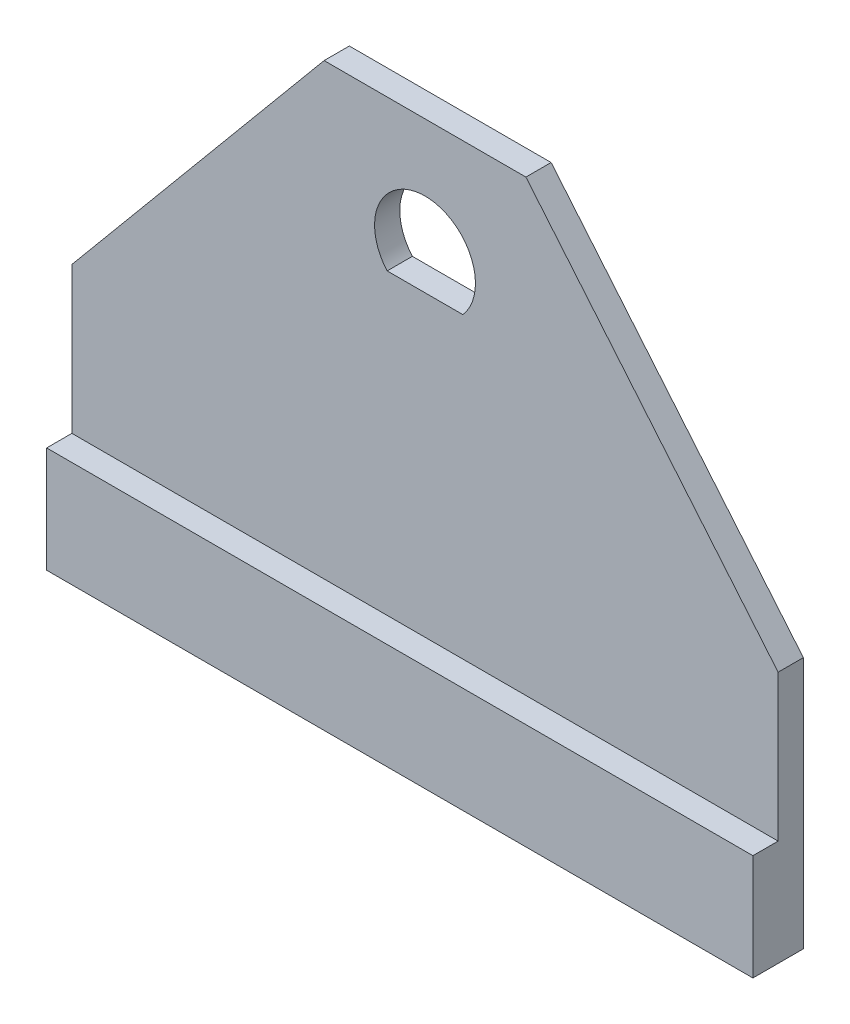
ISO-10303-21;
HEADER;
FILE_DESCRIPTION(('STEP AP214'),'2;1');
FILE_NAME('part.step','',(''),(''),'','','');
FILE_SCHEMA(('AUTOMOTIVE_DESIGN { 1 0 10303 214 1 1 1 1 }'));
ENDSEC;
DATA;
#1=APPLICATION_CONTEXT('core data for automotive mechanical design processes');
#2=APPLICATION_PROTOCOL_DEFINITION('international standard','automotive_design',2000,#1);
#3=PRODUCT_CONTEXT('',#1,'mechanical');
#4=PRODUCT('Part','Part','',(#3));
#5=PRODUCT_RELATED_PRODUCT_CATEGORY('part','',(#4));
#6=PRODUCT_DEFINITION_FORMATION('','',#4);
#7=PRODUCT_DEFINITION_CONTEXT('part definition',#1,'design');
#8=PRODUCT_DEFINITION('design','',#6,#7);
#9=PRODUCT_DEFINITION_SHAPE('','',#8);
#10=(LENGTH_UNIT() NAMED_UNIT(*) SI_UNIT(.MILLI.,.METRE.));
#11=(NAMED_UNIT(*) PLANE_ANGLE_UNIT() SI_UNIT($,.RADIAN.));
#12=(NAMED_UNIT(*) SI_UNIT($,.STERADIAN.) SOLID_ANGLE_UNIT());
#13=UNCERTAINTY_MEASURE_WITH_UNIT(LENGTH_MEASURE(1.E-05),#10,'distance_accuracy_value','');
#14=(GEOMETRIC_REPRESENTATION_CONTEXT(3) GLOBAL_UNCERTAINTY_ASSIGNED_CONTEXT((#13)) GLOBAL_UNIT_ASSIGNED_CONTEXT((#10,
#11,#12)) REPRESENTATION_CONTEXT('',''));
#15=CARTESIAN_POINT('',(0.,0.,0.));
#16=DIRECTION('',(0.,0.,1.));
#17=DIRECTION('',(1.,0.,0.));
#18=AXIS2_PLACEMENT_3D('',#15,#16,#17);
#19=CARTESIAN_POINT('',(0.,20.7435401417875,-5.));
#20=DIRECTION('',(0.,1.,0.));
#21=DIRECTION('',(-1.,0.,0.));
#22=AXIS2_PLACEMENT_3D('',#19,#20,#21);
#23=PLANE('',#22);
#24=DIRECTION('',(1.,0.,0.));
#25=VECTOR('',#24,1.);
#26=CARTESIAN_POINT('',(0.,20.7435401417875,-10.));
#27=LINE('',#26,#25);
#28=CARTESIAN_POINT('',(-87.0647432619508,20.7435401417875,-10.));
#29=VERTEX_POINT('',#28);
#30=CARTESIAN_POINT('',(-72.0647432619508,20.7435401417875,-10.));
#31=VERTEX_POINT('',#30);
#32=EDGE_CURVE('E133',#29,#31,#27,.T.);
#33=ORIENTED_EDGE('',*,*,#32,.F.);
#34=DIRECTION('',(0.,0.,-1.));
#35=VECTOR('',#34,1.);
#36=CARTESIAN_POINT('',(-87.0647432619508,20.7435401417875,-5.));
#37=LINE('',#36,#35);
#38=CARTESIAN_POINT('',(-87.0647432619508,20.7435401417875,-5.));
#39=VERTEX_POINT('',#38);
#40=EDGE_CURVE('E11',#39,#29,#37,.T.);
#41=ORIENTED_EDGE('',*,*,#40,.F.);
#42=DIRECTION('',(1.,0.,0.));
#43=VECTOR('',#42,1.);
#44=CARTESIAN_POINT('',(0.,20.7435401417875,-5.));
#45=LINE('',#44,#43);
#46=CARTESIAN_POINT('',(-72.0647432619508,20.7435401417875,-5.));
#47=VERTEX_POINT('',#46);
#48=EDGE_CURVE('E113',#39,#47,#45,.T.);
#49=ORIENTED_EDGE('',*,*,#48,.T.);
#50=DIRECTION('',(0.,0.,-1.));
#51=VECTOR('',#50,1.);
#52=CARTESIAN_POINT('',(-72.0647432619508,20.7435401417875,-5.));
#53=LINE('',#52,#51);
#54=EDGE_CURVE('E44',#47,#31,#53,.T.);
#55=ORIENTED_EDGE('',*,*,#54,.T.);
#56=EDGE_LOOP('',(#33,#41,#49,#55));
#57=FACE_BOUND('',#56,.T.);
#58=ADVANCED_FACE('F34',(#57),#23,.T.);
#59=CARTESIAN_POINT('',(-149.564743261951,0.,-5.));
#60=DIRECTION('',(1.,0.,0.));
#61=DIRECTION('',(0.,0.,-1.));
#62=AXIS2_PLACEMENT_3D('',#59,#60,#61);
#63=PLANE('',#62);
#64=DIRECTION('',(0.,-1.,0.));
#65=VECTOR('',#64,1.);
#66=CARTESIAN_POINT('',(-149.564743261951,0.,-10.));
#67=LINE('',#66,#65);
#68=CARTESIAN_POINT('',(-149.564743261951,-9.39660942741897,-10.));
#69=VERTEX_POINT('',#68);
#70=CARTESIAN_POINT('',(-149.564743261951,-59.396609427419,-10.));
#71=VERTEX_POINT('',#70);
#72=EDGE_CURVE('E152',#69,#71,#67,.T.);
#73=ORIENTED_EDGE('',*,*,#72,.T.);
#74=DIRECTION('',(0.,0.,1.));
#75=VECTOR('',#74,1.);
#76=CARTESIAN_POINT('',(-149.564743261951,-59.396609427419,-10.));
#77=LINE('',#76,#75);
#78=CARTESIAN_POINT('',(-149.564743261951,-59.396609427419,0.));
#79=VERTEX_POINT('',#78);
#80=EDGE_CURVE('E234',#71,#79,#77,.T.);
#81=ORIENTED_EDGE('',*,*,#80,.T.);
#82=DIRECTION('',(0.,-1.,0.));
#83=VECTOR('',#82,1.);
#84=CARTESIAN_POINT('',(-149.564743261951,0.,0.));
#85=LINE('',#84,#83);
#86=CARTESIAN_POINT('',(-149.564743261951,-38.3957936990256,0.));
#87=VERTEX_POINT('',#86);
#88=EDGE_CURVE('E226',#87,#79,#85,.T.);
#89=ORIENTED_EDGE('',*,*,#88,.F.);
#90=DIRECTION('',(0.,0.,1.));
#91=VECTOR('',#90,1.);
#92=CARTESIAN_POINT('',(-149.564743261951,-38.3957936990256,-10.));
#93=LINE('',#92,#91);
#94=CARTESIAN_POINT('',(-149.564743261951,-38.3957936990256,-5.));
#95=VERTEX_POINT('',#94);
#96=EDGE_CURVE('E128',#95,#87,#93,.T.);
#97=ORIENTED_EDGE('',*,*,#96,.F.);
#98=DIRECTION('',(0.,-1.,0.));
#99=VECTOR('',#98,1.);
#100=CARTESIAN_POINT('',(-149.564743261951,0.,-5.));
#101=LINE('',#100,#99);
#102=CARTESIAN_POINT('',(-149.564743261951,-9.39660942741897,-5.));
#103=VERTEX_POINT('',#102);
#104=EDGE_CURVE('E107',#103,#95,#101,.T.);
#105=ORIENTED_EDGE('',*,*,#104,.F.);
#106=DIRECTION('',(0.,0.,-1.));
#107=VECTOR('',#106,1.);
#108=CARTESIAN_POINT('',(-149.564743261951,-9.39660942741897,-5.));
#109=LINE('',#108,#107);
#110=EDGE_CURVE('E116',#103,#69,#109,.T.);
#111=ORIENTED_EDGE('',*,*,#110,.T.);
#112=EDGE_LOOP('',(#73,#81,#89,#97,#105,#111));
#113=FACE_BOUND('',#112,.T.);
#114=ADVANCED_FACE('F36',(#113),#63,.F.);
#115=CARTESIAN_POINT('',(-9.56474326195082,0.,-5.));
#116=DIRECTION('',(-1.,0.,0.));
#117=DIRECTION('',(0.,0.,1.));
#118=AXIS2_PLACEMENT_3D('',#115,#116,#117);
#119=PLANE('',#118);
#120=DIRECTION('',(0.,1.,0.));
#121=VECTOR('',#120,1.);
#122=CARTESIAN_POINT('',(-9.56474326195082,0.,-10.));
#123=LINE('',#122,#121);
#124=CARTESIAN_POINT('',(-9.56474326195082,-59.396609427419,-10.));
#125=VERTEX_POINT('',#124);
#126=CARTESIAN_POINT('',(-9.56474326195082,-9.39660942741897,-10.));
#127=VERTEX_POINT('',#126);
#128=EDGE_CURVE('E154',#125,#127,#123,.T.);
#129=ORIENTED_EDGE('',*,*,#128,.T.);
#130=DIRECTION('',(0.,0.,-1.));
#131=VECTOR('',#130,1.);
#132=CARTESIAN_POINT('',(-9.56474326195082,-9.39660942741897,-5.));
#133=LINE('',#132,#131);
#134=CARTESIAN_POINT('',(-9.56474326195082,-9.39660942741897,-5.));
#135=VERTEX_POINT('',#134);
#136=EDGE_CURVE('E141',#135,#127,#133,.T.);
#137=ORIENTED_EDGE('',*,*,#136,.F.);
#138=DIRECTION('',(0.,1.,0.));
#139=VECTOR('',#138,1.);
#140=CARTESIAN_POINT('',(-9.56474326195082,0.,-5.));
#141=LINE('',#140,#139);
#142=CARTESIAN_POINT('',(-9.56474326195082,-38.3957936990256,-5.));
#143=VERTEX_POINT('',#142);
#144=EDGE_CURVE('E131',#143,#135,#141,.T.);
#145=ORIENTED_EDGE('',*,*,#144,.F.);
#146=DIRECTION('',(0.,0.,1.));
#147=VECTOR('',#146,1.);
#148=CARTESIAN_POINT('',(-9.56474326195082,-38.3957936990256,-10.));
#149=LINE('',#148,#147);
#150=CARTESIAN_POINT('',(-9.56474326195082,-38.3957936990256,0.));
#151=VERTEX_POINT('',#150);
#152=EDGE_CURVE('E87',#143,#151,#149,.T.);
#153=ORIENTED_EDGE('',*,*,#152,.T.);
#154=DIRECTION('',(0.,1.,0.));
#155=VECTOR('',#154,1.);
#156=CARTESIAN_POINT('',(-9.56474326195082,0.,0.));
#157=LINE('',#156,#155);
#158=CARTESIAN_POINT('',(-9.56474326195082,-59.396609427419,0.));
#159=VERTEX_POINT('',#158);
#160=EDGE_CURVE('E229',#159,#151,#157,.T.);
#161=ORIENTED_EDGE('',*,*,#160,.F.);
#162=DIRECTION('',(0.,0.,1.));
#163=VECTOR('',#162,1.);
#164=CARTESIAN_POINT('',(-9.56474326195082,-59.396609427419,-10.));
#165=LINE('',#164,#163);
#166=EDGE_CURVE('E245',#125,#159,#165,.T.);
#167=ORIENTED_EDGE('',*,*,#166,.F.);
#168=EDGE_LOOP('',(#129,#137,#145,#153,#161,#167));
#169=FACE_BOUND('',#168,.T.);
#170=ADVANCED_FACE('F193',(#169),#119,.F.);
#171=CARTESIAN_POINT('',(-10.2660498402098,-8.55504153350818,-5.));
#172=DIRECTION('',(-0.768221279597376,-0.64018439966448,0.));
#173=DIRECTION('',(0.64018439966448,-0.768221279597376,0.));
#174=AXIS2_PLACEMENT_3D('',#171,#172,#173);
#175=PLANE('',#174);
#176=DIRECTION('',(-0.64018439966448,0.768221279597376,0.));
#177=VECTOR('',#176,1.);
#178=CARTESIAN_POINT('',(-10.2660498402098,-8.55504153350818,-10.));
#179=LINE('',#178,#177);
#180=CARTESIAN_POINT('',(-59.5647432619508,50.603390572581,-10.));
#181=VERTEX_POINT('',#180);
#182=EDGE_CURVE('E156',#127,#181,#179,.T.);
#183=ORIENTED_EDGE('',*,*,#182,.T.);
#184=DIRECTION('',(0.,0.,-1.));
#185=VECTOR('',#184,1.);
#186=CARTESIAN_POINT('',(-59.5647432619508,50.603390572581,-5.));
#187=LINE('',#186,#185);
#188=CARTESIAN_POINT('',(-59.5647432619508,50.603390572581,-5.));
#189=VERTEX_POINT('',#188);
#190=EDGE_CURVE('E164',#189,#181,#187,.T.);
#191=ORIENTED_EDGE('',*,*,#190,.F.);
#192=DIRECTION('',(-0.64018439966448,0.768221279597376,0.));
#193=VECTOR('',#192,1.);
#194=CARTESIAN_POINT('',(-10.2660498402098,-8.55504153350818,-5.));
#195=LINE('',#194,#193);
#196=EDGE_CURVE('E138',#135,#189,#195,.T.);
#197=ORIENTED_EDGE('',*,*,#196,.F.);
#198=ORIENTED_EDGE('',*,*,#136,.T.);
#199=EDGE_LOOP('',(#183,#191,#197,#198));
#200=FACE_BOUND('',#199,.T.);
#201=ADVANCED_FACE('F174',(#200),#175,.F.);
#202=CARTESIAN_POINT('',(0.,50.603390572581,-5.));
#203=DIRECTION('',(0.,-1.,0.));
#204=DIRECTION('',(0.,0.,-1.));
#205=AXIS2_PLACEMENT_3D('',#202,#203,#204);
#206=PLANE('',#205);
#207=DIRECTION('',(-1.,0.,0.));
#208=VECTOR('',#207,1.);
#209=CARTESIAN_POINT('',(0.,50.603390572581,-10.));
#210=LINE('',#209,#208);
#211=CARTESIAN_POINT('',(-99.5647432619508,50.603390572581,-10.));
#212=VERTEX_POINT('',#211);
#213=EDGE_CURVE('E158',#181,#212,#210,.T.);
#214=ORIENTED_EDGE('',*,*,#213,.T.);
#215=DIRECTION('',(0.,0.,-1.));
#216=VECTOR('',#215,1.);
#217=CARTESIAN_POINT('',(-99.5647432619508,50.603390572581,-5.));
#218=LINE('',#217,#216);
#219=CARTESIAN_POINT('',(-99.5647432619508,50.603390572581,-5.));
#220=VERTEX_POINT('',#219);
#221=EDGE_CURVE('E123',#220,#212,#218,.T.);
#222=ORIENTED_EDGE('',*,*,#221,.F.);
#223=DIRECTION('',(-1.,0.,0.));
#224=VECTOR('',#223,1.);
#225=CARTESIAN_POINT('',(0.,50.603390572581,-5.));
#226=LINE('',#225,#224);
#227=EDGE_CURVE('E109',#189,#220,#226,.T.);
#228=ORIENTED_EDGE('',*,*,#227,.F.);
#229=ORIENTED_EDGE('',*,*,#190,.T.);
#230=EDGE_LOOP('',(#214,#222,#228,#229));
#231=FACE_BOUND('',#230,.T.);
#232=ADVANCED_FACE('F184',(#231),#206,.F.);
#233=CARTESIAN_POINT('',(-83.6464340099616,69.705361674968,-5.));
#234=DIRECTION('',(0.768221279597376,-0.64018439966448,0.));
#235=DIRECTION('',(0.64018439966448,0.768221279597376,0.));
#236=AXIS2_PLACEMENT_3D('',#233,#234,#235);
#237=PLANE('',#236);
#238=DIRECTION('',(-0.64018439966448,-0.768221279597376,0.));
#239=VECTOR('',#238,1.);
#240=CARTESIAN_POINT('',(-83.6464340099616,69.705361674968,-10.));
#241=LINE('',#240,#239);
#242=EDGE_CURVE('E119',#212,#69,#241,.T.);
#243=ORIENTED_EDGE('',*,*,#242,.T.);
#244=ORIENTED_EDGE('',*,*,#110,.F.);
#245=DIRECTION('',(-0.64018439966448,-0.768221279597376,0.));
#246=VECTOR('',#245,1.);
#247=CARTESIAN_POINT('',(-83.6464340099616,69.705361674968,-5.));
#248=LINE('',#247,#246);
#249=EDGE_CURVE('E103',#220,#103,#248,.T.);
#250=ORIENTED_EDGE('',*,*,#249,.F.);
#251=ORIENTED_EDGE('',*,*,#221,.T.);
#252=EDGE_LOOP('',(#243,#244,#250,#251));
#253=FACE_BOUND('',#252,.T.);
#254=ADVANCED_FACE('F117',(#253),#237,.F.);
#255=CARTESIAN_POINT('',(-79.5647432619508,27.357918419449,-5.));
#256=DIRECTION('',(0.,0.,-1.));
#257=DIRECTION('',(-1.,0.,0.));
#258=AXIS2_PLACEMENT_3D('',#255,#256,#257);
#259=CYLINDRICAL_SURFACE('',#258,10.);
#260=CARTESIAN_POINT('',(-79.5647432619508,27.357918419449,-10.));
#261=DIRECTION('',(0.,0.,1.));
#262=DIRECTION('',(1.,0.,0.));
#263=AXIS2_PLACEMENT_3D('',#260,#261,#262);
#264=CIRCLE('',#263,10.);
#265=EDGE_CURVE('E130',#29,#31,#264,.F.);
#266=ORIENTED_EDGE('',*,*,#265,.T.);
#267=ORIENTED_EDGE('',*,*,#54,.F.);
#268=CARTESIAN_POINT('',(-79.5647432619508,27.357918419449,-5.));
#269=DIRECTION('',(0.,0.,1.));
#270=DIRECTION('',(1.,0.,0.));
#271=AXIS2_PLACEMENT_3D('',#268,#269,#270);
#272=CIRCLE('',#271,10.);
#273=EDGE_CURVE('E52',#39,#47,#272,.F.);
#274=ORIENTED_EDGE('',*,*,#273,.F.);
#275=ORIENTED_EDGE('',*,*,#40,.T.);
#276=EDGE_LOOP('',(#266,#267,#274,#275));
#277=FACE_BOUND('',#276,.T.);
#278=ADVANCED_FACE('F191',(#277),#259,.F.);
#279=CARTESIAN_POINT('',(0.,0.,-5.));
#280=DIRECTION('',(0.,0.,1.));
#281=DIRECTION('',(1.,0.,0.));
#282=AXIS2_PLACEMENT_3D('',#279,#280,#281);
#283=PLANE('',#282);
#284=ORIENTED_EDGE('',*,*,#104,.T.);
#285=DIRECTION('',(1.,0.,0.));
#286=VECTOR('',#285,1.);
#287=CARTESIAN_POINT('',(0.,-38.3957936990256,-5.));
#288=LINE('',#287,#286);
#289=EDGE_CURVE('E129',#95,#143,#288,.T.);
#290=ORIENTED_EDGE('',*,*,#289,.T.);
#291=ORIENTED_EDGE('',*,*,#144,.T.);
#292=ORIENTED_EDGE('',*,*,#196,.T.);
#293=ORIENTED_EDGE('',*,*,#227,.T.);
#294=ORIENTED_EDGE('',*,*,#249,.T.);
#295=EDGE_LOOP('',(#284,#290,#291,#292,#293,#294));
#296=FACE_BOUND('',#295,.T.);
#297=ORIENTED_EDGE('',*,*,#48,.F.);
#298=ORIENTED_EDGE('',*,*,#273,.T.);
#299=EDGE_LOOP('',(#297,#298));
#300=FACE_BOUND('',#299,.T.);
#301=ADVANCED_FACE('F105',(#296,#300),#283,.T.);
#302=CARTESIAN_POINT('',(0.,0.,-10.));
#303=DIRECTION('',(0.,0.,1.));
#304=DIRECTION('',(1.,0.,0.));
#305=AXIS2_PLACEMENT_3D('',#302,#303,#304);
#306=PLANE('',#305);
#307=ORIENTED_EDGE('',*,*,#72,.F.);
#308=ORIENTED_EDGE('',*,*,#242,.F.);
#309=ORIENTED_EDGE('',*,*,#213,.F.);
#310=ORIENTED_EDGE('',*,*,#182,.F.);
#311=ORIENTED_EDGE('',*,*,#128,.F.);
#312=DIRECTION('',(1.,0.,0.));
#313=VECTOR('',#312,1.);
#314=CARTESIAN_POINT('',(0.,-59.396609427419,-10.));
#315=LINE('',#314,#313);
#316=EDGE_CURVE('E242',#71,#125,#315,.T.);
#317=ORIENTED_EDGE('',*,*,#316,.F.);
#318=EDGE_LOOP('',(#307,#308,#309,#310,#311,#317));
#319=FACE_BOUND('',#318,.T.);
#320=ORIENTED_EDGE('',*,*,#32,.T.);
#321=ORIENTED_EDGE('',*,*,#265,.F.);
#322=EDGE_LOOP('',(#320,#321));
#323=FACE_BOUND('',#322,.T.);
#324=ADVANCED_FACE('F179',(#319,#323),#306,.F.);
#325=CARTESIAN_POINT('',(0.,-38.3957936990256,-10.));
#326=DIRECTION('',(0.,-1.,0.));
#327=DIRECTION('',(0.,0.,-1.));
#328=AXIS2_PLACEMENT_3D('',#325,#326,#327);
#329=PLANE('',#328);
#330=ORIENTED_EDGE('',*,*,#289,.F.);
#331=ORIENTED_EDGE('',*,*,#96,.T.);
#332=DIRECTION('',(1.,0.,0.));
#333=VECTOR('',#332,1.);
#334=CARTESIAN_POINT('',(0.,-38.3957936990256,0.));
#335=LINE('',#334,#333);
#336=EDGE_CURVE('E223',#87,#151,#335,.T.);
#337=ORIENTED_EDGE('',*,*,#336,.T.);
#338=ORIENTED_EDGE('',*,*,#152,.F.);
#339=EDGE_LOOP('',(#330,#331,#337,#338));
#340=FACE_BOUND('',#339,.T.);
#341=ADVANCED_FACE('F205',(#340),#329,.F.);
#342=CARTESIAN_POINT('',(0.,-59.396609427419,-10.));
#343=DIRECTION('',(0.,-1.,0.));
#344=DIRECTION('',(1.,0.,0.));
#345=AXIS2_PLACEMENT_3D('',#342,#343,#344);
#346=PLANE('',#345);
#347=DIRECTION('',(1.,0.,0.));
#348=VECTOR('',#347,1.);
#349=CARTESIAN_POINT('',(0.,-59.396609427419,0.));
#350=LINE('',#349,#348);
#351=EDGE_CURVE('E236',#79,#159,#350,.T.);
#352=ORIENTED_EDGE('',*,*,#351,.F.);
#353=ORIENTED_EDGE('',*,*,#80,.F.);
#354=ORIENTED_EDGE('',*,*,#316,.T.);
#355=ORIENTED_EDGE('',*,*,#166,.T.);
#356=EDGE_LOOP('',(#352,#353,#354,#355));
#357=FACE_BOUND('',#356,.T.);
#358=ADVANCED_FACE('F210',(#357),#346,.T.);
#359=CARTESIAN_POINT('',(0.,0.,0.));
#360=DIRECTION('',(0.,0.,1.));
#361=DIRECTION('',(1.,0.,0.));
#362=AXIS2_PLACEMENT_3D('',#359,#360,#361);
#363=PLANE('',#362);
#364=ORIENTED_EDGE('',*,*,#336,.F.);
#365=ORIENTED_EDGE('',*,*,#88,.T.);
#366=ORIENTED_EDGE('',*,*,#351,.T.);
#367=ORIENTED_EDGE('',*,*,#160,.T.);
#368=EDGE_LOOP('',(#364,#365,#366,#367));
#369=FACE_BOUND('',#368,.T.);
#370=ADVANCED_FACE('F213',(#369),#363,.T.);
#371=CLOSED_SHELL('',(#58,#114,#170,#201,#232,#254,#278,#301,#324,#341,#358,#370));
#372=MANIFOLD_SOLID_BREP('B2',#371);
#373=ADVANCED_BREP_SHAPE_REPRESENTATION('',(#18,#372),#14);
#374=SHAPE_DEFINITION_REPRESENTATION(#9,#373);
ENDSEC;
END-ISO-10303-21;
